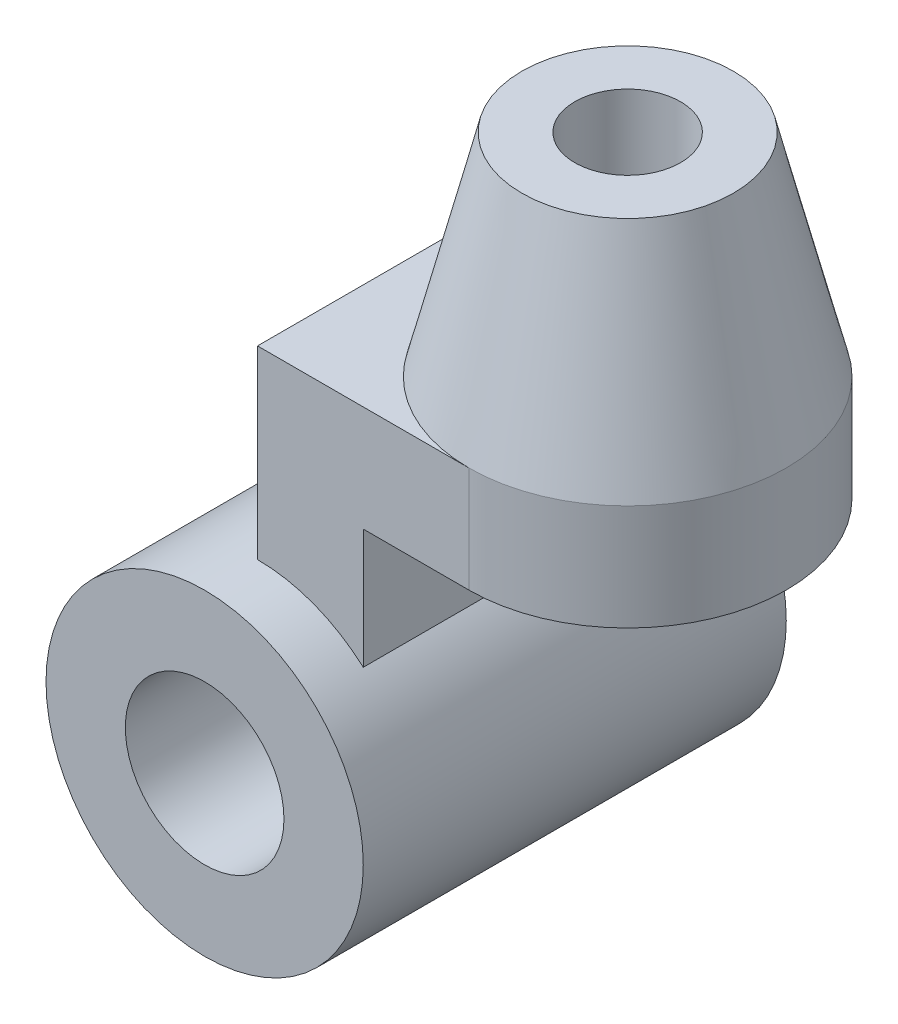
ISO-10303-21;
HEADER;
FILE_DESCRIPTION(('STEP AP214'),'2;1');
FILE_NAME('part.step','',(''),(''),'','','');
FILE_SCHEMA(('AUTOMOTIVE_DESIGN { 1 0 10303 214 1 1 1 1 }'));
ENDSEC;
DATA;
#1=APPLICATION_CONTEXT('core data for automotive mechanical design processes');
#2=APPLICATION_PROTOCOL_DEFINITION('international standard','automotive_design',2000,#1);
#3=PRODUCT_CONTEXT('',#1,'mechanical');
#4=PRODUCT('Part','Part','',(#3));
#5=PRODUCT_RELATED_PRODUCT_CATEGORY('part','',(#4));
#6=PRODUCT_DEFINITION_FORMATION('','',#4);
#7=PRODUCT_DEFINITION_CONTEXT('part definition',#1,'design');
#8=PRODUCT_DEFINITION('design','',#6,#7);
#9=PRODUCT_DEFINITION_SHAPE('','',#8);
#10=(LENGTH_UNIT() NAMED_UNIT(*) SI_UNIT(.MILLI.,.METRE.));
#11=(NAMED_UNIT(*) PLANE_ANGLE_UNIT() SI_UNIT($,.RADIAN.));
#12=(NAMED_UNIT(*) SI_UNIT($,.STERADIAN.) SOLID_ANGLE_UNIT());
#13=UNCERTAINTY_MEASURE_WITH_UNIT(LENGTH_MEASURE(1.E-05),#10,'distance_accuracy_value','');
#14=(GEOMETRIC_REPRESENTATION_CONTEXT(3) GLOBAL_UNCERTAINTY_ASSIGNED_CONTEXT((#13)) GLOBAL_UNIT_ASSIGNED_CONTEXT((#10,
#11,#12)) REPRESENTATION_CONTEXT('',''));
#15=CARTESIAN_POINT('',(0.,0.,0.));
#16=DIRECTION('',(0.,0.,1.));
#17=DIRECTION('',(1.,0.,0.));
#18=AXIS2_PLACEMENT_3D('',#15,#16,#17);
#19=CARTESIAN_POINT('',(0.,0.,400.));
#20=DIRECTION('',(0.,0.,1.));
#21=DIRECTION('',(1.,0.,0.));
#22=AXIS2_PLACEMENT_3D('',#19,#20,#21);
#23=PLANE('',#22);
#24=CARTESIAN_POINT('',(0.,0.,400.));
#25=DIRECTION('',(0.,0.,1.));
#26=DIRECTION('',(1.,0.,0.));
#27=AXIS2_PLACEMENT_3D('',#24,#25,#26);
#28=CIRCLE('',#27,300.);
#29=CARTESIAN_POINT('',(300.,0.,400.));
#30=VERTEX_POINT('',#29);
#31=EDGE_CURVE('E11',#30,#30,#28,.T.);
#32=ORIENTED_EDGE('',*,*,#31,.T.);
#33=EDGE_LOOP('',(#32));
#34=FACE_BOUND('',#33,.T.);
#35=CARTESIAN_POINT('',(0.,0.,400.));
#36=DIRECTION('',(0.,0.,1.));
#37=DIRECTION('',(1.,0.,0.));
#38=AXIS2_PLACEMENT_3D('',#35,#36,#37);
#39=CIRCLE('',#38,150.);
#40=CARTESIAN_POINT('',(150.,0.,400.));
#41=VERTEX_POINT('',#40);
#42=EDGE_CURVE('E156',#41,#41,#39,.T.);
#43=ORIENTED_EDGE('',*,*,#42,.F.);
#44=EDGE_LOOP('',(#43));
#45=FACE_BOUND('',#44,.T.);
#46=ADVANCED_FACE('F33',(#34,#45),#23,.T.);
#47=CARTESIAN_POINT('',(0.,0.,-400.));
#48=DIRECTION('',(0.,0.,1.));
#49=DIRECTION('',(1.,0.,0.));
#50=AXIS2_PLACEMENT_3D('',#47,#48,#49);
#51=PLANE('',#50);
#52=CARTESIAN_POINT('',(0.,0.,-400.));
#53=DIRECTION('',(0.,0.,1.));
#54=DIRECTION('',(1.,0.,0.));
#55=AXIS2_PLACEMENT_3D('',#52,#53,#54);
#56=CIRCLE('',#55,300.);
#57=CARTESIAN_POINT('',(300.,0.,-400.));
#58=VERTEX_POINT('',#57);
#59=EDGE_CURVE('E37',#58,#58,#56,.T.);
#60=ORIENTED_EDGE('',*,*,#59,.F.);
#61=EDGE_LOOP('',(#60));
#62=FACE_BOUND('',#61,.T.);
#63=CARTESIAN_POINT('',(0.,0.,-400.));
#64=DIRECTION('',(0.,0.,1.));
#65=DIRECTION('',(1.,0.,0.));
#66=AXIS2_PLACEMENT_3D('',#63,#64,#65);
#67=CIRCLE('',#66,150.);
#68=CARTESIAN_POINT('',(150.,0.,-400.));
#69=VERTEX_POINT('',#68);
#70=EDGE_CURVE('E155',#69,#69,#67,.T.);
#71=ORIENTED_EDGE('',*,*,#70,.T.);
#72=EDGE_LOOP('',(#71));
#73=FACE_BOUND('',#72,.T.);
#74=ADVANCED_FACE('F162',(#62,#73),#51,.F.);
#75=CARTESIAN_POINT('',(0.,0.,400.));
#76=DIRECTION('',(0.,0.,-1.));
#77=DIRECTION('',(-1.,0.,0.));
#78=AXIS2_PLACEMENT_3D('',#75,#76,#77);
#79=CYLINDRICAL_SURFACE('',#78,300.);
#80=CARTESIAN_POINT('',(300.,0.,0.));
#81=VERTEX_POINT('',#80);
#82=VERTEX_LOOP('',#81);
#83=FACE_BOUND('',#82,.T.);
#84=DIRECTION('',(0.,0.,-1.));
#85=VECTOR('',#84,1.);
#86=CARTESIAN_POINT('',(200.,223.606797749979,300.));
#87=LINE('',#86,#85);
#88=CARTESIAN_POINT('',(200.,223.606797749979,300.));
#89=VERTEX_POINT('',#88);
#90=CARTESIAN_POINT('',(200.,223.606797749979,-300.));
#91=VERTEX_POINT('',#90);
#92=EDGE_CURVE('E51',#89,#91,#87,.T.);
#93=ORIENTED_EDGE('',*,*,#92,.F.);
#94=CARTESIAN_POINT('',(0.,0.,300.));
#95=DIRECTION('',(0.,0.,-1.));
#96=DIRECTION('',(1.,0.,0.));
#97=AXIS2_PLACEMENT_3D('',#94,#95,#96);
#98=CIRCLE('',#97,300.);
#99=CARTESIAN_POINT('',(0.,300.,300.));
#100=VERTEX_POINT('',#99);
#101=EDGE_CURVE('E129',#100,#89,#98,.T.);
#102=ORIENTED_EDGE('',*,*,#101,.F.);
#103=DIRECTION('',(0.,0.,-1.));
#104=VECTOR('',#103,1.);
#105=CARTESIAN_POINT('',(0.,300.,300.));
#106=LINE('',#105,#104);
#107=CARTESIAN_POINT('',(0.,300.,-300.));
#108=VERTEX_POINT('',#107);
#109=EDGE_CURVE('E142',#100,#108,#106,.T.);
#110=ORIENTED_EDGE('',*,*,#109,.T.);
#111=CARTESIAN_POINT('',(0.,0.,-300.));
#112=DIRECTION('',(0.,0.,-1.));
#113=DIRECTION('',(1.,0.,0.));
#114=AXIS2_PLACEMENT_3D('',#111,#112,#113);
#115=CIRCLE('',#114,300.);
#116=EDGE_CURVE('E128',#108,#91,#115,.T.);
#117=ORIENTED_EDGE('',*,*,#116,.T.);
#118=EDGE_LOOP('',(#93,#102,#110,#117));
#119=FACE_BOUND('',#118,.T.);
#120=ORIENTED_EDGE('',*,*,#31,.F.);
#121=EDGE_LOOP('',(#120));
#122=FACE_BOUND('',#121,.T.);
#123=ORIENTED_EDGE('',*,*,#59,.T.);
#124=EDGE_LOOP('',(#123));
#125=FACE_BOUND('',#124,.T.);
#126=ADVANCED_FACE('F35',(#83,#119,#122,#125),#79,.T.);
#127=CARTESIAN_POINT('',(0.,0.,400.));
#128=DIRECTION('',(0.,0.,-1.));
#129=DIRECTION('',(-1.,0.,0.));
#130=AXIS2_PLACEMENT_3D('',#127,#128,#129);
#131=CYLINDRICAL_SURFACE('',#130,150.);
#132=ORIENTED_EDGE('',*,*,#42,.T.);
#133=EDGE_LOOP('',(#132));
#134=FACE_BOUND('',#133,.T.);
#135=ORIENTED_EDGE('',*,*,#70,.F.);
#136=EDGE_LOOP('',(#135));
#137=FACE_BOUND('',#136,.T.);
#138=ADVANCED_FACE('F164',(#134,#137),#131,.F.);
#139=CARTESIAN_POINT('',(200.,450.,300.));
#140=DIRECTION('',(-1.,0.,0.));
#141=DIRECTION('',(0.,-1.,0.));
#142=AXIS2_PLACEMENT_3D('',#139,#140,#141);
#143=PLANE('',#142);
#144=DIRECTION('',(0.,1.,0.));
#145=VECTOR('',#144,1.);
#146=CARTESIAN_POINT('',(200.,450.,-300.));
#147=LINE('',#146,#145);
#148=CARTESIAN_POINT('',(200.,450.,-300.));
#149=VERTEX_POINT('',#148);
#150=EDGE_CURVE('E144',#91,#149,#147,.T.);
#151=ORIENTED_EDGE('',*,*,#150,.T.);
#152=DIRECTION('',(0.,0.,-1.));
#153=VECTOR('',#152,1.);
#154=CARTESIAN_POINT('',(200.,450.,300.));
#155=LINE('',#154,#153);
#156=CARTESIAN_POINT('',(200.,450.,300.));
#157=VERTEX_POINT('',#156);
#158=EDGE_CURVE('E152',#157,#149,#155,.T.);
#159=ORIENTED_EDGE('',*,*,#158,.F.);
#160=DIRECTION('',(0.,1.,0.));
#161=VECTOR('',#160,1.);
#162=CARTESIAN_POINT('',(200.,450.,300.));
#163=LINE('',#162,#161);
#164=EDGE_CURVE('E132',#89,#157,#163,.T.);
#165=ORIENTED_EDGE('',*,*,#164,.F.);
#166=ORIENTED_EDGE('',*,*,#92,.T.);
#167=EDGE_LOOP('',(#151,#159,#165,#166));
#168=FACE_BOUND('',#167,.T.);
#169=ADVANCED_FACE('F166',(#168),#143,.F.);
#170=CARTESIAN_POINT('',(400.,450.,300.));
#171=DIRECTION('',(0.,1.,0.));
#172=DIRECTION('',(0.,0.,1.));
#173=AXIS2_PLACEMENT_3D('',#170,#171,#172);
#174=PLANE('',#173);
#175=DIRECTION('',(1.,0.,0.));
#176=VECTOR('',#175,1.);
#177=CARTESIAN_POINT('',(400.,450.,-300.));
#178=LINE('',#177,#176);
#179=CARTESIAN_POINT('',(400.,450.,-300.));
#180=VERTEX_POINT('',#179);
#181=EDGE_CURVE('E116',#149,#180,#178,.T.);
#182=ORIENTED_EDGE('',*,*,#181,.T.);
#183=CARTESIAN_POINT('',(400.,450.,0.));
#184=DIRECTION('',(0.,1.,0.));
#185=DIRECTION('',(-1.,0.,0.));
#186=AXIS2_PLACEMENT_3D('',#183,#184,#185);
#187=CIRCLE('',#186,300.);
#188=CARTESIAN_POINT('',(400.,450.,300.));
#189=VERTEX_POINT('',#188);
#190=EDGE_CURVE('E115',#189,#180,#187,.T.);
#191=ORIENTED_EDGE('',*,*,#190,.F.);
#192=DIRECTION('',(1.,0.,0.));
#193=VECTOR('',#192,1.);
#194=CARTESIAN_POINT('',(400.,450.,300.));
#195=LINE('',#194,#193);
#196=EDGE_CURVE('E134',#157,#189,#195,.T.);
#197=ORIENTED_EDGE('',*,*,#196,.F.);
#198=ORIENTED_EDGE('',*,*,#158,.T.);
#199=EDGE_LOOP('',(#182,#191,#197,#198));
#200=FACE_BOUND('',#199,.T.);
#201=CARTESIAN_POINT('',(400.,450.,0.));
#202=DIRECTION('',(0.,1.,0.));
#203=DIRECTION('',(-1.,0.,0.));
#204=AXIS2_PLACEMENT_3D('',#201,#202,#203);
#205=CIRCLE('',#204,100.);
#206=CARTESIAN_POINT('',(300.,450.,0.));
#207=VERTEX_POINT('',#206);
#208=EDGE_CURVE('E119',#207,#207,#205,.T.);
#209=ORIENTED_EDGE('',*,*,#208,.T.);
#210=EDGE_LOOP('',(#209));
#211=FACE_BOUND('',#210,.T.);
#212=ADVANCED_FACE('F173',(#200,#211),#174,.F.);
#213=CARTESIAN_POINT('',(0.,650.,300.));
#214=DIRECTION('',(0.,-1.,0.));
#215=DIRECTION('',(0.,0.,-1.));
#216=AXIS2_PLACEMENT_3D('',#213,#214,#215);
#217=PLANE('',#216);
#218=CARTESIAN_POINT('',(400.,650.,0.));
#219=DIRECTION('',(0.,1.,0.));
#220=DIRECTION('',(-1.,0.,0.));
#221=AXIS2_PLACEMENT_3D('',#218,#219,#220);
#222=CIRCLE('',#221,300.);
#223=CARTESIAN_POINT('',(400.,650.,-300.));
#224=VERTEX_POINT('',#223);
#225=CARTESIAN_POINT('',(400.,650.,300.));
#226=VERTEX_POINT('',#225);
#227=EDGE_CURVE('E102',#224,#226,#222,.T.);
#228=ORIENTED_EDGE('',*,*,#227,.F.);
#229=DIRECTION('',(-1.,0.,0.));
#230=VECTOR('',#229,1.);
#231=CARTESIAN_POINT('',(0.,650.,-300.));
#232=LINE('',#231,#230);
#233=CARTESIAN_POINT('',(0.,650.,-300.));
#234=VERTEX_POINT('',#233);
#235=EDGE_CURVE('E86',#224,#234,#232,.T.);
#236=ORIENTED_EDGE('',*,*,#235,.T.);
#237=DIRECTION('',(0.,0.,-1.));
#238=VECTOR('',#237,1.);
#239=CARTESIAN_POINT('',(0.,650.,300.));
#240=LINE('',#239,#238);
#241=CARTESIAN_POINT('',(0.,650.,300.));
#242=VERTEX_POINT('',#241);
#243=EDGE_CURVE('E150',#242,#234,#240,.T.);
#244=ORIENTED_EDGE('',*,*,#243,.F.);
#245=DIRECTION('',(-1.,0.,0.));
#246=VECTOR('',#245,1.);
#247=CARTESIAN_POINT('',(0.,650.,300.));
#248=LINE('',#247,#246);
#249=EDGE_CURVE('E104',#226,#242,#248,.T.);
#250=ORIENTED_EDGE('',*,*,#249,.F.);
#251=EDGE_LOOP('',(#228,#236,#244,#250));
#252=FACE_BOUND('',#251,.T.);
#253=ADVANCED_FACE('F103',(#252),#217,.F.);
#254=CARTESIAN_POINT('',(0.,300.,300.));
#255=DIRECTION('',(1.,0.,0.));
#256=DIRECTION('',(0.,0.,-1.));
#257=AXIS2_PLACEMENT_3D('',#254,#255,#256);
#258=PLANE('',#257);
#259=DIRECTION('',(0.,-1.,0.));
#260=VECTOR('',#259,1.);
#261=CARTESIAN_POINT('',(0.,300.,-300.));
#262=LINE('',#261,#260);
#263=EDGE_CURVE('E95',#234,#108,#262,.T.);
#264=ORIENTED_EDGE('',*,*,#263,.T.);
#265=ORIENTED_EDGE('',*,*,#109,.F.);
#266=DIRECTION('',(0.,-1.,0.));
#267=VECTOR('',#266,1.);
#268=CARTESIAN_POINT('',(0.,300.,300.));
#269=LINE('',#268,#267);
#270=EDGE_CURVE('E139',#242,#100,#269,.T.);
#271=ORIENTED_EDGE('',*,*,#270,.F.);
#272=ORIENTED_EDGE('',*,*,#243,.T.);
#273=EDGE_LOOP('',(#264,#265,#271,#272));
#274=FACE_BOUND('',#273,.T.);
#275=ADVANCED_FACE('F253',(#274),#258,.F.);
#276=CARTESIAN_POINT('',(0.,0.,300.));
#277=DIRECTION('',(0.,0.,1.));
#278=DIRECTION('',(1.,0.,0.));
#279=AXIS2_PLACEMENT_3D('',#276,#277,#278);
#280=PLANE('',#279);
#281=ORIENTED_EDGE('',*,*,#101,.T.);
#282=ORIENTED_EDGE('',*,*,#164,.T.);
#283=ORIENTED_EDGE('',*,*,#196,.T.);
#284=DIRECTION('',(0.,1.,0.));
#285=VECTOR('',#284,1.);
#286=CARTESIAN_POINT('',(400.,650.,300.));
#287=LINE('',#286,#285);
#288=EDGE_CURVE('E136',#189,#226,#287,.T.);
#289=ORIENTED_EDGE('',*,*,#288,.T.);
#290=ORIENTED_EDGE('',*,*,#249,.T.);
#291=ORIENTED_EDGE('',*,*,#270,.T.);
#292=EDGE_LOOP('',(#281,#282,#283,#289,#290,#291));
#293=FACE_BOUND('',#292,.T.);
#294=ADVANCED_FACE('F251',(#293),#280,.T.);
#295=CARTESIAN_POINT('',(0.,0.,-300.));
#296=DIRECTION('',(0.,0.,1.));
#297=DIRECTION('',(1.,0.,0.));
#298=AXIS2_PLACEMENT_3D('',#295,#296,#297);
#299=PLANE('',#298);
#300=ORIENTED_EDGE('',*,*,#116,.F.);
#301=ORIENTED_EDGE('',*,*,#263,.F.);
#302=ORIENTED_EDGE('',*,*,#235,.F.);
#303=DIRECTION('',(0.,1.,0.));
#304=VECTOR('',#303,1.);
#305=CARTESIAN_POINT('',(400.,650.,-300.));
#306=LINE('',#305,#304);
#307=EDGE_CURVE('E92',#180,#224,#306,.T.);
#308=ORIENTED_EDGE('',*,*,#307,.F.);
#309=ORIENTED_EDGE('',*,*,#181,.F.);
#310=ORIENTED_EDGE('',*,*,#150,.F.);
#311=EDGE_LOOP('',(#300,#301,#302,#308,#309,#310));
#312=FACE_BOUND('',#311,.T.);
#313=ADVANCED_FACE('F89',(#312),#299,.F.);
#314=CARTESIAN_POINT('',(400.,1046.54746269892,0.));
#315=DIRECTION('',(0.,1.,0.));
#316=DIRECTION('',(-1.,0.,0.));
#317=AXIS2_PLACEMENT_3D('',#314,#315,#316);
#318=CYLINDRICAL_SURFACE('',#317,100.);
#319=ORIENTED_EDGE('',*,*,#208,.F.);
#320=EDGE_LOOP('',(#319));
#321=FACE_BOUND('',#320,.T.);
#322=CARTESIAN_POINT('',(400.,1050.,0.));
#323=DIRECTION('',(0.,1.,0.));
#324=DIRECTION('',(-1.,0.,0.));
#325=AXIS2_PLACEMENT_3D('',#322,#323,#324);
#326=CIRCLE('',#325,100.);
#327=CARTESIAN_POINT('',(300.,1050.,0.));
#328=VERTEX_POINT('',#327);
#329=EDGE_CURVE('E125',#328,#328,#326,.T.);
#330=ORIENTED_EDGE('',*,*,#329,.T.);
#331=EDGE_LOOP('',(#330));
#332=FACE_BOUND('',#331,.T.);
#333=ADVANCED_FACE('F220',(#321,#332),#318,.F.);
#334=CARTESIAN_POINT('',(400.,1046.54746269892,0.));
#335=DIRECTION('',(0.,1.,0.));
#336=DIRECTION('',(-1.,0.,0.));
#337=AXIS2_PLACEMENT_3D('',#334,#335,#336);
#338=CYLINDRICAL_SURFACE('',#337,300.);
#339=EDGE_CURVE('E108',#226,#224,#222,.T.);
#340=ORIENTED_EDGE('',*,*,#339,.F.);
#341=ORIENTED_EDGE('',*,*,#288,.F.);
#342=ORIENTED_EDGE('',*,*,#190,.T.);
#343=ORIENTED_EDGE('',*,*,#307,.T.);
#344=EDGE_LOOP('',(#340,#341,#342,#343));
#345=FACE_BOUND('',#344,.T.);
#346=ADVANCED_FACE('F112',(#345),#338,.T.);
#347=CARTESIAN_POINT('',(600.,1050.,0.));
#348=DIRECTION('',(0.,-1.,0.));
#349=DIRECTION('',(1.,0.,0.));
#350=AXIS2_PLACEMENT_3D('',#347,#348,#349);
#351=PLANE('',#350);
#352=ORIENTED_EDGE('',*,*,#329,.F.);
#353=EDGE_LOOP('',(#352));
#354=FACE_BOUND('',#353,.T.);
#355=CARTESIAN_POINT('',(400.,1050.,0.));
#356=DIRECTION('',(0.,1.,0.));
#357=DIRECTION('',(-1.,0.,0.));
#358=AXIS2_PLACEMENT_3D('',#355,#356,#357);
#359=CIRCLE('',#358,200.);
#360=CARTESIAN_POINT('',(200.,1050.,0.));
#361=VERTEX_POINT('',#360);
#362=EDGE_CURVE('E109',#361,#361,#359,.T.);
#363=ORIENTED_EDGE('',*,*,#362,.T.);
#364=EDGE_LOOP('',(#363));
#365=FACE_BOUND('',#364,.T.);
#366=ADVANCED_FACE('F237',(#354,#365),#351,.F.);
#367=CARTESIAN_POINT('',(400.,650.,0.));
#368=DIRECTION('',(0.,-1.,0.));
#369=DIRECTION('',(1.,0.,0.));
#370=AXIS2_PLACEMENT_3D('',#367,#368,#369);
#371=CONICAL_SURFACE('',#370,300.,0.244978663126864);
#372=ORIENTED_EDGE('',*,*,#362,.F.);
#373=EDGE_LOOP('',(#372));
#374=FACE_BOUND('',#373,.T.);
#375=ORIENTED_EDGE('',*,*,#339,.T.);
#376=ORIENTED_EDGE('',*,*,#227,.T.);
#377=EDGE_LOOP('',(#375,#376));
#378=FACE_BOUND('',#377,.T.);
#379=ADVANCED_FACE('F118',(#374,#378),#371,.T.);
#380=CLOSED_SHELL('',(#46,#74,#126,#138,#169,#212,#253,#275,#294,#313,#333,#346,#366,#379));
#381=MANIFOLD_SOLID_BREP('B2',#380);
#382=ADVANCED_BREP_SHAPE_REPRESENTATION('',(#18,#381),#14);
#383=SHAPE_DEFINITION_REPRESENTATION(#9,#382);
ENDSEC;
END-ISO-10303-21;
